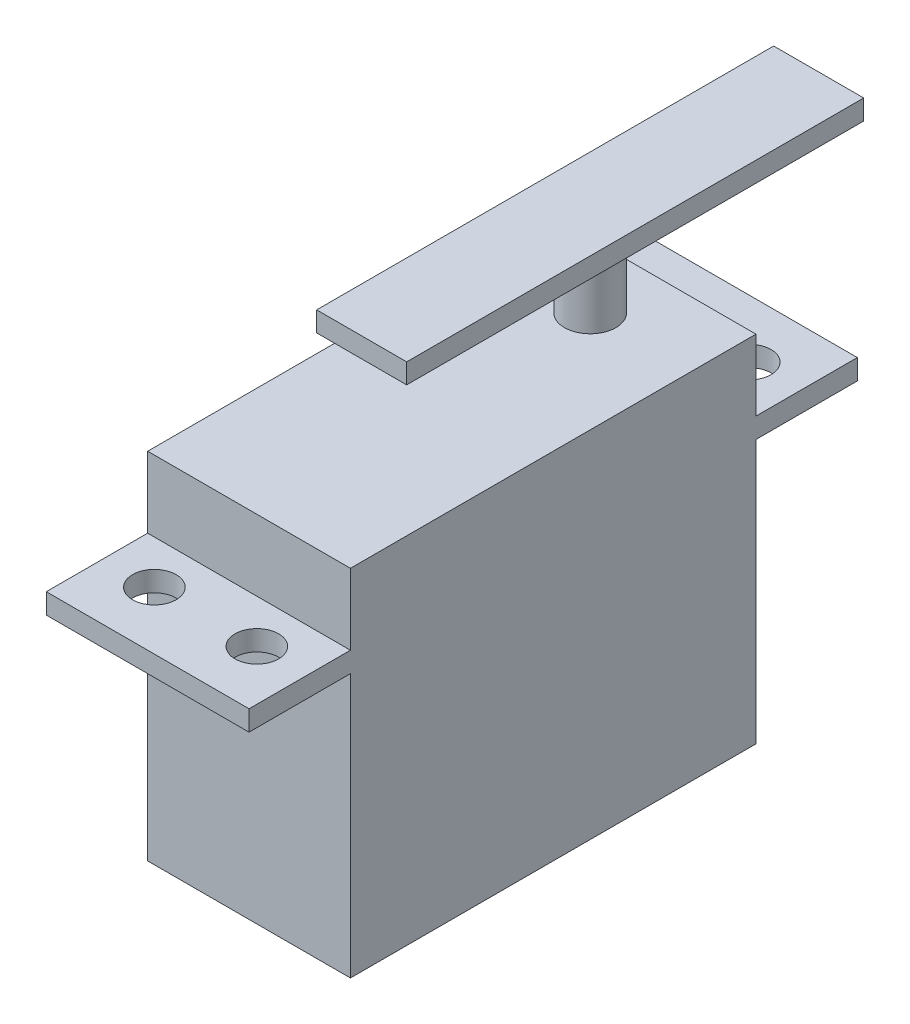
ISO-10303-21;
HEADER;
FILE_DESCRIPTION(('STEP AP214'),'2;1');
FILE_NAME('part.step','',(''),(''),'','','');
FILE_SCHEMA(('AUTOMOTIVE_DESIGN { 1 0 10303 214 1 1 1 1 }'));
ENDSEC;
DATA;
#1=APPLICATION_CONTEXT('core data for automotive mechanical design processes');
#2=APPLICATION_PROTOCOL_DEFINITION('international standard','automotive_design',2000,#1);
#3=PRODUCT_CONTEXT('',#1,'mechanical');
#4=PRODUCT('Part','Part','',(#3));
#5=PRODUCT_RELATED_PRODUCT_CATEGORY('part','',(#4));
#6=PRODUCT_DEFINITION_FORMATION('','',#4);
#7=PRODUCT_DEFINITION_CONTEXT('part definition',#1,'design');
#8=PRODUCT_DEFINITION('design','',#6,#7);
#9=PRODUCT_DEFINITION_SHAPE('','',#8);
#10=(LENGTH_UNIT() NAMED_UNIT(*) SI_UNIT(.MILLI.,.METRE.));
#11=(NAMED_UNIT(*) PLANE_ANGLE_UNIT() SI_UNIT($,.RADIAN.));
#12=(NAMED_UNIT(*) SI_UNIT($,.STERADIAN.) SOLID_ANGLE_UNIT());
#13=UNCERTAINTY_MEASURE_WITH_UNIT(LENGTH_MEASURE(1.E-05),#10,'distance_accuracy_value','');
#14=(GEOMETRIC_REPRESENTATION_CONTEXT(3) GLOBAL_UNCERTAINTY_ASSIGNED_CONTEXT((#13)) GLOBAL_UNIT_ASSIGNED_CONTEXT((#10,
#11,#12)) REPRESENTATION_CONTEXT('',''));
#15=CARTESIAN_POINT('',(0.,0.,0.));
#16=DIRECTION('',(0.,0.,1.));
#17=DIRECTION('',(1.,0.,0.));
#18=AXIS2_PLACEMENT_3D('',#15,#16,#17);
#19=CARTESIAN_POINT('',(-10.,9.,-20.));
#20=DIRECTION('',(0.,0.,1.));
#21=DIRECTION('',(1.,0.,0.));
#22=AXIS2_PLACEMENT_3D('',#19,#20,#21);
#23=PLANE('',#22);
#24=DIRECTION('',(1.,0.,0.));
#25=VECTOR('',#24,1.);
#26=CARTESIAN_POINT('',(9.99999999999999,2.,-20.));
#27=LINE('',#26,#25);
#28=CARTESIAN_POINT('',(-10.,2.,-20.));
#29=VERTEX_POINT('',#28);
#30=CARTESIAN_POINT('',(9.99999999999999,2.,-20.));
#31=VERTEX_POINT('',#30);
#32=EDGE_CURVE('E56',#29,#31,#27,.T.);
#33=ORIENTED_EDGE('',*,*,#32,.F.);
#34=DIRECTION('',(0.,-1.,0.));
#35=VECTOR('',#34,1.);
#36=CARTESIAN_POINT('',(-10.,9.,-20.));
#37=LINE('',#36,#35);
#38=CARTESIAN_POINT('',(-10.,9.,-20.));
#39=VERTEX_POINT('',#38);
#40=EDGE_CURVE('E266',#39,#29,#37,.T.);
#41=ORIENTED_EDGE('',*,*,#40,.F.);
#42=DIRECTION('',(-1.,0.,0.));
#43=VECTOR('',#42,1.);
#44=CARTESIAN_POINT('',(-10.,9.,-20.));
#45=LINE('',#44,#43);
#46=CARTESIAN_POINT('',(9.99999999999999,9.,-20.));
#47=VERTEX_POINT('',#46);
#48=EDGE_CURVE('E146',#47,#39,#45,.T.);
#49=ORIENTED_EDGE('',*,*,#48,.F.);
#50=DIRECTION('',(0.,-1.,0.));
#51=VECTOR('',#50,1.);
#52=CARTESIAN_POINT('',(9.99999999999999,9.,-20.));
#53=LINE('',#52,#51);
#54=EDGE_CURVE('E11',#47,#31,#53,.T.);
#55=ORIENTED_EDGE('',*,*,#54,.T.);
#56=EDGE_LOOP('',(#33,#41,#49,#55));
#57=FACE_BOUND('',#56,.T.);
#58=ADVANCED_FACE('F34',(#57),#23,.F.);
#59=CARTESIAN_POINT('',(-10.,9.,20.));
#60=DIRECTION('',(0.,0.,-1.));
#61=DIRECTION('',(-1.,0.,0.));
#62=AXIS2_PLACEMENT_3D('',#59,#60,#61);
#63=PLANE('',#62);
#64=DIRECTION('',(-1.,0.,0.));
#65=VECTOR('',#64,1.);
#66=CARTESIAN_POINT('',(9.99999999999999,2.,20.));
#67=LINE('',#66,#65);
#68=CARTESIAN_POINT('',(9.99999999999999,2.,20.));
#69=VERTEX_POINT('',#68);
#70=CARTESIAN_POINT('',(-10.,2.,20.));
#71=VERTEX_POINT('',#70);
#72=EDGE_CURVE('E186',#69,#71,#67,.T.);
#73=ORIENTED_EDGE('',*,*,#72,.F.);
#74=DIRECTION('',(0.,-1.,0.));
#75=VECTOR('',#74,1.);
#76=CARTESIAN_POINT('',(9.99999999999999,9.,20.));
#77=LINE('',#76,#75);
#78=CARTESIAN_POINT('',(9.99999999999999,9.,20.));
#79=VERTEX_POINT('',#78);
#80=EDGE_CURVE('E262',#79,#69,#77,.T.);
#81=ORIENTED_EDGE('',*,*,#80,.F.);
#82=DIRECTION('',(1.,0.,0.));
#83=VECTOR('',#82,1.);
#84=CARTESIAN_POINT('',(-10.,9.,20.));
#85=LINE('',#84,#83);
#86=CARTESIAN_POINT('',(-10.,9.,20.));
#87=VERTEX_POINT('',#86);
#88=EDGE_CURVE('E259',#87,#79,#85,.T.);
#89=ORIENTED_EDGE('',*,*,#88,.F.);
#90=DIRECTION('',(0.,-1.,0.));
#91=VECTOR('',#90,1.);
#92=CARTESIAN_POINT('',(-10.,9.,20.));
#93=LINE('',#92,#91);
#94=EDGE_CURVE('E265',#87,#71,#93,.T.);
#95=ORIENTED_EDGE('',*,*,#94,.T.);
#96=EDGE_LOOP('',(#73,#81,#89,#95));
#97=FACE_BOUND('',#96,.T.);
#98=ADVANCED_FACE('F303',(#97),#63,.F.);
#99=CARTESIAN_POINT('',(9.99999999999999,9.,-20.));
#100=DIRECTION('',(-1.,0.,0.));
#101=DIRECTION('',(0.,0.,1.));
#102=AXIS2_PLACEMENT_3D('',#99,#100,#101);
#103=PLANE('',#102);
#104=ORIENTED_EDGE('',*,*,#80,.T.);
#105=DIRECTION('',(0.,0.,-1.));
#106=VECTOR('',#105,1.);
#107=CARTESIAN_POINT('',(9.99999999999999,2.,20.));
#108=LINE('',#107,#106);
#109=CARTESIAN_POINT('',(10.,2.,30.));
#110=VERTEX_POINT('',#109);
#111=EDGE_CURVE('E183',#110,#69,#108,.T.);
#112=ORIENTED_EDGE('',*,*,#111,.F.);
#113=DIRECTION('',(0.,-1.,0.));
#114=VECTOR('',#113,1.);
#115=CARTESIAN_POINT('',(10.,2.,30.));
#116=LINE('',#115,#114);
#117=CARTESIAN_POINT('',(10.,0.,30.));
#118=VERTEX_POINT('',#117);
#119=EDGE_CURVE('E194',#110,#118,#116,.T.);
#120=ORIENTED_EDGE('',*,*,#119,.T.);
#121=DIRECTION('',(0.,0.,-1.));
#122=VECTOR('',#121,1.);
#123=CARTESIAN_POINT('',(9.99999999999999,0.,20.));
#124=LINE('',#123,#122);
#125=CARTESIAN_POINT('',(9.99999999999999,0.,20.));
#126=VERTEX_POINT('',#125);
#127=EDGE_CURVE('E182',#118,#126,#124,.T.);
#128=ORIENTED_EDGE('',*,*,#127,.T.);
#129=CARTESIAN_POINT('',(9.99999999999999,-26.,20.));
#130=VERTEX_POINT('',#129);
#131=EDGE_CURVE('E261',#126,#130,#77,.T.);
#132=ORIENTED_EDGE('',*,*,#131,.T.);
#133=DIRECTION('',(0.,0.,-1.));
#134=VECTOR('',#133,1.);
#135=CARTESIAN_POINT('',(9.99999999999999,-26.,-20.));
#136=LINE('',#135,#134);
#137=CARTESIAN_POINT('',(9.99999999999999,-26.,-20.));
#138=VERTEX_POINT('',#137);
#139=EDGE_CURVE('E241',#130,#138,#136,.T.);
#140=ORIENTED_EDGE('',*,*,#139,.T.);
#141=CARTESIAN_POINT('',(9.99999999999999,0.,-20.));
#142=VERTEX_POINT('',#141);
#143=EDGE_CURVE('E42',#142,#138,#53,.T.);
#144=ORIENTED_EDGE('',*,*,#143,.F.);
#145=DIRECTION('',(0.,0.,-1.));
#146=VECTOR('',#145,1.);
#147=CARTESIAN_POINT('',(9.99999999999999,0.,-20.));
#148=LINE('',#147,#146);
#149=CARTESIAN_POINT('',(10.,0.,-30.));
#150=VERTEX_POINT('',#149);
#151=EDGE_CURVE('E176',#142,#150,#148,.T.);
#152=ORIENTED_EDGE('',*,*,#151,.T.);
#153=DIRECTION('',(0.,-1.,0.));
#154=VECTOR('',#153,1.);
#155=CARTESIAN_POINT('',(10.,2.,-30.));
#156=LINE('',#155,#154);
#157=CARTESIAN_POINT('',(10.,2.,-30.));
#158=VERTEX_POINT('',#157);
#159=EDGE_CURVE('E154',#158,#150,#156,.T.);
#160=ORIENTED_EDGE('',*,*,#159,.F.);
#161=DIRECTION('',(0.,0.,-1.));
#162=VECTOR('',#161,1.);
#163=CARTESIAN_POINT('',(9.99999999999999,2.,-20.));
#164=LINE('',#163,#162);
#165=EDGE_CURVE('E151',#31,#158,#164,.T.);
#166=ORIENTED_EDGE('',*,*,#165,.F.);
#167=ORIENTED_EDGE('',*,*,#54,.F.);
#168=DIRECTION('',(0.,0.,-1.));
#169=VECTOR('',#168,1.);
#170=CARTESIAN_POINT('',(9.99999999999999,9.,-20.));
#171=LINE('',#170,#169);
#172=EDGE_CURVE('E254',#79,#47,#171,.T.);
#173=ORIENTED_EDGE('',*,*,#172,.F.);
#174=EDGE_LOOP('',(#104,#112,#120,#128,#132,#140,#144,#152,#160,#166,#167,#173));
#175=FACE_BOUND('',#174,.T.);
#176=ADVANCED_FACE('F36',(#175),#103,.F.);
#177=CARTESIAN_POINT('',(-10.,0.,-20.));
#178=VERTEX_POINT('',#177);
#179=CARTESIAN_POINT('',(-10.,-26.,-20.));
#180=VERTEX_POINT('',#179);
#181=EDGE_CURVE('E49',#178,#180,#37,.T.);
#182=ORIENTED_EDGE('',*,*,#181,.F.);
#183=DIRECTION('',(1.,0.,0.));
#184=VECTOR('',#183,1.);
#185=CARTESIAN_POINT('',(9.99999999999999,0.,-20.));
#186=LINE('',#185,#184);
#187=EDGE_CURVE('E174',#178,#142,#186,.T.);
#188=ORIENTED_EDGE('',*,*,#187,.T.);
#189=ORIENTED_EDGE('',*,*,#143,.T.);
#190=DIRECTION('',(-1.,0.,0.));
#191=VECTOR('',#190,1.);
#192=CARTESIAN_POINT('',(-10.,-26.,-20.));
#193=LINE('',#192,#191);
#194=EDGE_CURVE('E246',#138,#180,#193,.T.);
#195=ORIENTED_EDGE('',*,*,#194,.T.);
#196=EDGE_LOOP('',(#182,#188,#189,#195));
#197=FACE_BOUND('',#196,.T.);
#198=ADVANCED_FACE('F279',(#197),#23,.F.);
#199=CARTESIAN_POINT('',(-10.,9.,-20.));
#200=DIRECTION('',(1.,0.,0.));
#201=DIRECTION('',(0.,0.,-1.));
#202=AXIS2_PLACEMENT_3D('',#199,#200,#201);
#203=PLANE('',#202);
#204=ORIENTED_EDGE('',*,*,#40,.T.);
#205=DIRECTION('',(0.,0.,1.));
#206=VECTOR('',#205,1.);
#207=CARTESIAN_POINT('',(-10.,2.,-20.));
#208=LINE('',#207,#206);
#209=CARTESIAN_POINT('',(-10.,2.,-30.));
#210=VERTEX_POINT('',#209);
#211=EDGE_CURVE('E162',#210,#29,#208,.T.);
#212=ORIENTED_EDGE('',*,*,#211,.F.);
#213=DIRECTION('',(0.,-1.,0.));
#214=VECTOR('',#213,1.);
#215=CARTESIAN_POINT('',(-10.,2.,-30.));
#216=LINE('',#215,#214);
#217=CARTESIAN_POINT('',(-10.,0.,-30.));
#218=VERTEX_POINT('',#217);
#219=EDGE_CURVE('E173',#210,#218,#216,.T.);
#220=ORIENTED_EDGE('',*,*,#219,.T.);
#221=DIRECTION('',(0.,0.,1.));
#222=VECTOR('',#221,1.);
#223=CARTESIAN_POINT('',(-10.,0.,-20.));
#224=LINE('',#223,#222);
#225=EDGE_CURVE('E163',#218,#178,#224,.T.);
#226=ORIENTED_EDGE('',*,*,#225,.T.);
#227=ORIENTED_EDGE('',*,*,#181,.T.);
#228=DIRECTION('',(0.,0.,1.));
#229=VECTOR('',#228,1.);
#230=CARTESIAN_POINT('',(-10.,-26.,-20.));
#231=LINE('',#230,#229);
#232=CARTESIAN_POINT('',(-10.,-26.,20.));
#233=VERTEX_POINT('',#232);
#234=EDGE_CURVE('E248',#180,#233,#231,.T.);
#235=ORIENTED_EDGE('',*,*,#234,.T.);
#236=CARTESIAN_POINT('',(-10.,0.,20.));
#237=VERTEX_POINT('',#236);
#238=EDGE_CURVE('E264',#237,#233,#93,.T.);
#239=ORIENTED_EDGE('',*,*,#238,.F.);
#240=DIRECTION('',(0.,0.,1.));
#241=VECTOR('',#240,1.);
#242=CARTESIAN_POINT('',(-10.,0.,20.));
#243=LINE('',#242,#241);
#244=CARTESIAN_POINT('',(-10.,0.,30.));
#245=VERTEX_POINT('',#244);
#246=EDGE_CURVE('E199',#237,#245,#243,.T.);
#247=ORIENTED_EDGE('',*,*,#246,.T.);
#248=DIRECTION('',(0.,-1.,0.));
#249=VECTOR('',#248,1.);
#250=CARTESIAN_POINT('',(-10.,2.,30.));
#251=LINE('',#250,#249);
#252=CARTESIAN_POINT('',(-10.,2.,30.));
#253=VERTEX_POINT('',#252);
#254=EDGE_CURVE('E204',#253,#245,#251,.T.);
#255=ORIENTED_EDGE('',*,*,#254,.F.);
#256=DIRECTION('',(0.,0.,1.));
#257=VECTOR('',#256,1.);
#258=CARTESIAN_POINT('',(-10.,2.,20.));
#259=LINE('',#258,#257);
#260=EDGE_CURVE('E190',#71,#253,#259,.T.);
#261=ORIENTED_EDGE('',*,*,#260,.F.);
#262=ORIENTED_EDGE('',*,*,#94,.F.);
#263=DIRECTION('',(0.,0.,1.));
#264=VECTOR('',#263,1.);
#265=CARTESIAN_POINT('',(-10.,9.,-20.));
#266=LINE('',#265,#264);
#267=EDGE_CURVE('E257',#39,#87,#266,.T.);
#268=ORIENTED_EDGE('',*,*,#267,.F.);
#269=EDGE_LOOP('',(#204,#212,#220,#226,#227,#235,#239,#247,#255,#261,#262,#268));
#270=FACE_BOUND('',#269,.T.);
#271=ADVANCED_FACE('F270',(#270),#203,.F.);
#272=ORIENTED_EDGE('',*,*,#131,.F.);
#273=DIRECTION('',(-1.,0.,0.));
#274=VECTOR('',#273,1.);
#275=CARTESIAN_POINT('',(9.99999999999999,0.,20.));
#276=LINE('',#275,#274);
#277=EDGE_CURVE('E197',#126,#237,#276,.T.);
#278=ORIENTED_EDGE('',*,*,#277,.T.);
#279=ORIENTED_EDGE('',*,*,#238,.T.);
#280=DIRECTION('',(1.,0.,0.));
#281=VECTOR('',#280,1.);
#282=CARTESIAN_POINT('',(-10.,-26.,20.));
#283=LINE('',#282,#281);
#284=EDGE_CURVE('E251',#233,#130,#283,.T.);
#285=ORIENTED_EDGE('',*,*,#284,.T.);
#286=EDGE_LOOP('',(#272,#278,#279,#285));
#287=FACE_BOUND('',#286,.T.);
#288=ADVANCED_FACE('F309',(#287),#63,.F.);
#289=CARTESIAN_POINT('',(0.,9.,0.));
#290=DIRECTION('',(0.,1.,0.));
#291=DIRECTION('',(0.,0.,1.));
#292=AXIS2_PLACEMENT_3D('',#289,#290,#291);
#293=PLANE('',#292);
#294=CARTESIAN_POINT('',(0.,9.,-13.65));
#295=DIRECTION('',(0.,1.,0.));
#296=DIRECTION('',(0.,0.,1.));
#297=AXIS2_PLACEMENT_3D('',#294,#295,#296);
#298=CIRCLE('',#297,2.54);
#299=CARTESIAN_POINT('',(0.,9.,-11.11));
#300=VERTEX_POINT('',#299);
#301=EDGE_CURVE('E237',#300,#300,#298,.T.);
#302=ORIENTED_EDGE('',*,*,#301,.F.);
#303=EDGE_LOOP('',(#302));
#304=FACE_BOUND('',#303,.T.);
#305=ORIENTED_EDGE('',*,*,#172,.T.);
#306=ORIENTED_EDGE('',*,*,#48,.T.);
#307=ORIENTED_EDGE('',*,*,#267,.T.);
#308=ORIENTED_EDGE('',*,*,#88,.T.);
#309=EDGE_LOOP('',(#305,#306,#307,#308));
#310=FACE_BOUND('',#309,.T.);
#311=ADVANCED_FACE('F406',(#304,#310),#293,.T.);
#312=CARTESIAN_POINT('',(0.,-26.,0.));
#313=DIRECTION('',(0.,1.,0.));
#314=DIRECTION('',(0.,0.,1.));
#315=AXIS2_PLACEMENT_3D('',#312,#313,#314);
#316=PLANE('',#315);
#317=ORIENTED_EDGE('',*,*,#139,.F.);
#318=ORIENTED_EDGE('',*,*,#284,.F.);
#319=ORIENTED_EDGE('',*,*,#234,.F.);
#320=ORIENTED_EDGE('',*,*,#194,.F.);
#321=EDGE_LOOP('',(#317,#318,#319,#320));
#322=FACE_BOUND('',#321,.T.);
#323=ADVANCED_FACE('F278',(#322),#316,.F.);
#324=CARTESIAN_POINT('',(0.,16.33,-13.65));
#325=DIRECTION('',(0.,-1.,0.));
#326=DIRECTION('',(0.,0.,-1.));
#327=AXIS2_PLACEMENT_3D('',#324,#325,#326);
#328=CYLINDRICAL_SURFACE('',#327,2.54);
#329=CARTESIAN_POINT('',(0.,16.33,-13.65));
#330=DIRECTION('',(0.,1.,0.));
#331=DIRECTION('',(0.,0.,1.));
#332=AXIS2_PLACEMENT_3D('',#329,#330,#331);
#333=CIRCLE('',#332,2.54);
#334=CARTESIAN_POINT('',(0.,16.33,-11.11));
#335=VERTEX_POINT('',#334);
#336=EDGE_CURVE('E238',#335,#335,#333,.T.);
#337=ORIENTED_EDGE('',*,*,#336,.F.);
#338=EDGE_LOOP('',(#337));
#339=FACE_BOUND('',#338,.T.);
#340=ORIENTED_EDGE('',*,*,#301,.T.);
#341=EDGE_LOOP('',(#340));
#342=FACE_BOUND('',#341,.T.);
#343=ADVANCED_FACE('F389',(#339,#342),#328,.T.);
#344=CARTESIAN_POINT('',(4.44,18.3,-36.19));
#345=DIRECTION('',(-1.,0.,0.));
#346=DIRECTION('',(0.,0.,1.));
#347=AXIS2_PLACEMENT_3D('',#344,#345,#346);
#348=PLANE('',#347);
#349=DIRECTION('',(0.,0.,-1.));
#350=VECTOR('',#349,1.);
#351=CARTESIAN_POINT('',(4.44,16.33,-36.19));
#352=LINE('',#351,#350);
#353=CARTESIAN_POINT('',(4.44,16.33,8.89));
#354=VERTEX_POINT('',#353);
#355=CARTESIAN_POINT('',(4.44,16.33,-36.19));
#356=VERTEX_POINT('',#355);
#357=EDGE_CURVE('E207',#354,#356,#352,.T.);
#358=ORIENTED_EDGE('',*,*,#357,.T.);
#359=DIRECTION('',(0.,-1.,0.));
#360=VECTOR('',#359,1.);
#361=CARTESIAN_POINT('',(4.44,18.3,-36.19));
#362=LINE('',#361,#360);
#363=CARTESIAN_POINT('',(4.44,18.3,-36.19));
#364=VERTEX_POINT('',#363);
#365=EDGE_CURVE('E234',#364,#356,#362,.T.);
#366=ORIENTED_EDGE('',*,*,#365,.F.);
#367=DIRECTION('',(0.,0.,-1.));
#368=VECTOR('',#367,1.);
#369=CARTESIAN_POINT('',(4.44,18.3,-36.19));
#370=LINE('',#369,#368);
#371=CARTESIAN_POINT('',(4.44,18.3,8.89));
#372=VERTEX_POINT('',#371);
#373=EDGE_CURVE('E208',#372,#364,#370,.T.);
#374=ORIENTED_EDGE('',*,*,#373,.F.);
#375=DIRECTION('',(0.,-1.,0.));
#376=VECTOR('',#375,1.);
#377=CARTESIAN_POINT('',(4.44,18.3,8.89));
#378=LINE('',#377,#376);
#379=EDGE_CURVE('E218',#372,#354,#378,.T.);
#380=ORIENTED_EDGE('',*,*,#379,.T.);
#381=EDGE_LOOP('',(#358,#366,#374,#380));
#382=FACE_BOUND('',#381,.T.);
#383=ADVANCED_FACE('F379',(#382),#348,.F.);
#384=CARTESIAN_POINT('',(-4.44,18.3,-36.19));
#385=DIRECTION('',(0.,0.,1.));
#386=DIRECTION('',(1.,0.,0.));
#387=AXIS2_PLACEMENT_3D('',#384,#385,#386);
#388=PLANE('',#387);
#389=DIRECTION('',(-1.,0.,0.));
#390=VECTOR('',#389,1.);
#391=CARTESIAN_POINT('',(-4.44,16.33,-36.19));
#392=LINE('',#391,#390);
#393=CARTESIAN_POINT('',(-4.44,16.33,-36.19));
#394=VERTEX_POINT('',#393);
#395=EDGE_CURVE('E221',#356,#394,#392,.T.);
#396=ORIENTED_EDGE('',*,*,#395,.T.);
#397=DIRECTION('',(0.,-1.,0.));
#398=VECTOR('',#397,1.);
#399=CARTESIAN_POINT('',(-4.44,18.3,-36.19));
#400=LINE('',#399,#398);
#401=CARTESIAN_POINT('',(-4.44,18.3,-36.19));
#402=VERTEX_POINT('',#401);
#403=EDGE_CURVE('E231',#402,#394,#400,.T.);
#404=ORIENTED_EDGE('',*,*,#403,.F.);
#405=DIRECTION('',(-1.,0.,0.));
#406=VECTOR('',#405,1.);
#407=CARTESIAN_POINT('',(-4.44,18.3,-36.19));
#408=LINE('',#407,#406);
#409=EDGE_CURVE('E211',#364,#402,#408,.T.);
#410=ORIENTED_EDGE('',*,*,#409,.F.);
#411=ORIENTED_EDGE('',*,*,#365,.T.);
#412=EDGE_LOOP('',(#396,#404,#410,#411));
#413=FACE_BOUND('',#412,.T.);
#414=ADVANCED_FACE('F369',(#413),#388,.F.);
#415=CARTESIAN_POINT('',(-4.44,18.3,-36.19));
#416=DIRECTION('',(1.,0.,0.));
#417=DIRECTION('',(0.,0.,-1.));
#418=AXIS2_PLACEMENT_3D('',#415,#416,#417);
#419=PLANE('',#418);
#420=DIRECTION('',(0.,0.,1.));
#421=VECTOR('',#420,1.);
#422=CARTESIAN_POINT('',(-4.44,16.33,-36.19));
#423=LINE('',#422,#421);
#424=CARTESIAN_POINT('',(-4.44,16.33,8.89));
#425=VERTEX_POINT('',#424);
#426=EDGE_CURVE('E223',#394,#425,#423,.T.);
#427=ORIENTED_EDGE('',*,*,#426,.T.);
#428=DIRECTION('',(0.,-1.,0.));
#429=VECTOR('',#428,1.);
#430=CARTESIAN_POINT('',(-4.44,18.3,8.89));
#431=LINE('',#430,#429);
#432=CARTESIAN_POINT('',(-4.44,18.3,8.89));
#433=VERTEX_POINT('',#432);
#434=EDGE_CURVE('E228',#433,#425,#431,.T.);
#435=ORIENTED_EDGE('',*,*,#434,.F.);
#436=DIRECTION('',(0.,0.,1.));
#437=VECTOR('',#436,1.);
#438=CARTESIAN_POINT('',(-4.44,18.3,-36.19));
#439=LINE('',#438,#437);
#440=EDGE_CURVE('E214',#402,#433,#439,.T.);
#441=ORIENTED_EDGE('',*,*,#440,.F.);
#442=ORIENTED_EDGE('',*,*,#403,.T.);
#443=EDGE_LOOP('',(#427,#435,#441,#442));
#444=FACE_BOUND('',#443,.T.);
#445=ADVANCED_FACE('F359',(#444),#419,.F.);
#446=CARTESIAN_POINT('',(-4.44,18.3,8.89));
#447=DIRECTION('',(0.,0.,-1.));
#448=DIRECTION('',(-1.,0.,0.));
#449=AXIS2_PLACEMENT_3D('',#446,#447,#448);
#450=PLANE('',#449);
#451=DIRECTION('',(1.,0.,0.));
#452=VECTOR('',#451,1.);
#453=CARTESIAN_POINT('',(-4.44,16.33,8.89));
#454=LINE('',#453,#452);
#455=EDGE_CURVE('E212',#425,#354,#454,.T.);
#456=ORIENTED_EDGE('',*,*,#455,.T.);
#457=ORIENTED_EDGE('',*,*,#379,.F.);
#458=DIRECTION('',(1.,0.,0.));
#459=VECTOR('',#458,1.);
#460=CARTESIAN_POINT('',(-4.44,18.3,8.89));
#461=LINE('',#460,#459);
#462=EDGE_CURVE('E216',#433,#372,#461,.T.);
#463=ORIENTED_EDGE('',*,*,#462,.F.);
#464=ORIENTED_EDGE('',*,*,#434,.T.);
#465=EDGE_LOOP('',(#456,#457,#463,#464));
#466=FACE_BOUND('',#465,.T.);
#467=ADVANCED_FACE('F349',(#466),#450,.F.);
#468=CARTESIAN_POINT('',(0.,18.3,0.));
#469=DIRECTION('',(0.,1.,0.));
#470=DIRECTION('',(0.,0.,1.));
#471=AXIS2_PLACEMENT_3D('',#468,#469,#470);
#472=PLANE('',#471);
#473=ORIENTED_EDGE('',*,*,#373,.T.);
#474=ORIENTED_EDGE('',*,*,#409,.T.);
#475=ORIENTED_EDGE('',*,*,#440,.T.);
#476=ORIENTED_EDGE('',*,*,#462,.T.);
#477=EDGE_LOOP('',(#473,#474,#475,#476));
#478=FACE_BOUND('',#477,.T.);
#479=ADVANCED_FACE('F338',(#478),#472,.T.);
#480=CARTESIAN_POINT('',(0.,16.33,0.));
#481=DIRECTION('',(0.,1.,0.));
#482=DIRECTION('',(0.,0.,1.));
#483=AXIS2_PLACEMENT_3D('',#480,#481,#482);
#484=PLANE('',#483);
#485=ORIENTED_EDGE('',*,*,#336,.T.);
#486=EDGE_LOOP('',(#485));
#487=FACE_BOUND('',#486,.T.);
#488=ORIENTED_EDGE('',*,*,#357,.F.);
#489=ORIENTED_EDGE('',*,*,#455,.F.);
#490=ORIENTED_EDGE('',*,*,#426,.F.);
#491=ORIENTED_EDGE('',*,*,#395,.F.);
#492=EDGE_LOOP('',(#488,#489,#490,#491));
#493=FACE_BOUND('',#492,.T.);
#494=ADVANCED_FACE('F333',(#487,#493),#484,.F.);
#495=CARTESIAN_POINT('',(10.,2.,30.));
#496=DIRECTION('',(0.,0.,-1.));
#497=DIRECTION('',(-1.,0.,0.));
#498=AXIS2_PLACEMENT_3D('',#495,#496,#497);
#499=PLANE('',#498);
#500=DIRECTION('',(1.,0.,0.));
#501=VECTOR('',#500,1.);
#502=CARTESIAN_POINT('',(10.,0.,30.));
#503=LINE('',#502,#501);
#504=EDGE_CURVE('E187',#245,#118,#503,.T.);
#505=ORIENTED_EDGE('',*,*,#504,.T.);
#506=ORIENTED_EDGE('',*,*,#119,.F.);
#507=DIRECTION('',(1.,0.,0.));
#508=VECTOR('',#507,1.);
#509=CARTESIAN_POINT('',(10.,2.,30.));
#510=LINE('',#509,#508);
#511=EDGE_CURVE('E192',#253,#110,#510,.T.);
#512=ORIENTED_EDGE('',*,*,#511,.F.);
#513=ORIENTED_EDGE('',*,*,#254,.T.);
#514=EDGE_LOOP('',(#505,#506,#512,#513));
#515=FACE_BOUND('',#514,.T.);
#516=ADVANCED_FACE('F337',(#515),#499,.F.);
#517=CARTESIAN_POINT('',(0.,2.,0.));
#518=DIRECTION('',(0.,-1.,0.));
#519=DIRECTION('',(0.,0.,-1.));
#520=AXIS2_PLACEMENT_3D('',#517,#518,#519);
#521=PLANE('',#520);
#522=CARTESIAN_POINT('',(5.055,2.,24.285));
#523=DIRECTION('',(0.,-1.,0.));
#524=DIRECTION('',(0.,0.,-1.));
#525=AXIS2_PLACEMENT_3D('',#522,#523,#524);
#526=CIRCLE('',#525,2.15);
#527=CARTESIAN_POINT('',(5.055,2.,22.135));
#528=VERTEX_POINT('',#527);
#529=EDGE_CURVE('E168',#528,#528,#526,.F.);
#530=ORIENTED_EDGE('',*,*,#529,.F.);
#531=EDGE_LOOP('',(#530));
#532=FACE_BOUND('',#531,.T.);
#533=CARTESIAN_POINT('',(-5.055,2.,24.285));
#534=DIRECTION('',(0.,-1.,0.));
#535=DIRECTION('',(0.,0.,-1.));
#536=AXIS2_PLACEMENT_3D('',#533,#534,#535);
#537=CIRCLE('',#536,2.15);
#538=CARTESIAN_POINT('',(-5.055,2.,22.135));
#539=VERTEX_POINT('',#538);
#540=EDGE_CURVE('E452',#539,#539,#537,.F.);
#541=ORIENTED_EDGE('',*,*,#540,.F.);
#542=EDGE_LOOP('',(#541));
#543=FACE_BOUND('',#542,.T.);
#544=ORIENTED_EDGE('',*,*,#111,.T.);
#545=ORIENTED_EDGE('',*,*,#72,.T.);
#546=ORIENTED_EDGE('',*,*,#260,.T.);
#547=ORIENTED_EDGE('',*,*,#511,.T.);
#548=EDGE_LOOP('',(#544,#545,#546,#547));
#549=FACE_BOUND('',#548,.T.);
#550=ADVANCED_FACE('F297',(#532,#543,#549),#521,.F.);
#551=CARTESIAN_POINT('',(0.,0.,0.));
#552=DIRECTION('',(0.,-1.,0.));
#553=DIRECTION('',(0.,0.,-1.));
#554=AXIS2_PLACEMENT_3D('',#551,#552,#553);
#555=PLANE('',#554);
#556=CARTESIAN_POINT('',(5.055,0.,24.285));
#557=DIRECTION('',(0.,1.,0.));
#558=DIRECTION('',(0.,0.,1.));
#559=AXIS2_PLACEMENT_3D('',#556,#557,#558);
#560=CIRCLE('',#559,2.15);
#561=CARTESIAN_POINT('',(5.055,0.,26.435));
#562=VERTEX_POINT('',#561);
#563=EDGE_CURVE('E464',#562,#562,#560,.T.);
#564=ORIENTED_EDGE('',*,*,#563,.T.);
#565=EDGE_LOOP('',(#564));
#566=FACE_BOUND('',#565,.T.);
#567=CARTESIAN_POINT('',(-5.055,0.,24.285));
#568=DIRECTION('',(0.,1.,0.));
#569=DIRECTION('',(0.,0.,1.));
#570=AXIS2_PLACEMENT_3D('',#567,#568,#569);
#571=CIRCLE('',#570,2.15);
#572=CARTESIAN_POINT('',(-5.055,0.,26.435));
#573=VERTEX_POINT('',#572);
#574=EDGE_CURVE('E461',#573,#573,#571,.T.);
#575=ORIENTED_EDGE('',*,*,#574,.T.);
#576=EDGE_LOOP('',(#575));
#577=FACE_BOUND('',#576,.T.);
#578=ORIENTED_EDGE('',*,*,#127,.F.);
#579=ORIENTED_EDGE('',*,*,#504,.F.);
#580=ORIENTED_EDGE('',*,*,#246,.F.);
#581=ORIENTED_EDGE('',*,*,#277,.F.);
#582=EDGE_LOOP('',(#578,#579,#580,#581));
#583=FACE_BOUND('',#582,.T.);
#584=ADVANCED_FACE('F289',(#566,#577,#583),#555,.T.);
#585=CARTESIAN_POINT('',(10.,2.,-30.));
#586=DIRECTION('',(0.,0.,1.));
#587=DIRECTION('',(1.,0.,0.));
#588=AXIS2_PLACEMENT_3D('',#585,#586,#587);
#589=PLANE('',#588);
#590=DIRECTION('',(-1.,0.,0.));
#591=VECTOR('',#590,1.);
#592=CARTESIAN_POINT('',(10.,0.,-30.));
#593=LINE('',#592,#591);
#594=EDGE_CURVE('E165',#150,#218,#593,.T.);
#595=ORIENTED_EDGE('',*,*,#594,.T.);
#596=ORIENTED_EDGE('',*,*,#219,.F.);
#597=DIRECTION('',(-1.,0.,0.));
#598=VECTOR('',#597,1.);
#599=CARTESIAN_POINT('',(10.,2.,-30.));
#600=LINE('',#599,#598);
#601=EDGE_CURVE('E157',#158,#210,#600,.T.);
#602=ORIENTED_EDGE('',*,*,#601,.F.);
#603=ORIENTED_EDGE('',*,*,#159,.T.);
#604=EDGE_LOOP('',(#595,#596,#602,#603));
#605=FACE_BOUND('',#604,.T.);
#606=ADVANCED_FACE('F287',(#605),#589,.F.);
#607=CARTESIAN_POINT('',(0.,2.,0.));
#608=DIRECTION('',(0.,-1.,0.));
#609=DIRECTION('',(0.,0.,-1.));
#610=AXIS2_PLACEMENT_3D('',#607,#608,#609);
#611=PLANE('',#610);
#612=CARTESIAN_POINT('',(-5.055,2.,-24.285));
#613=DIRECTION('',(0.,-1.,0.));
#614=DIRECTION('',(0.,0.,-1.));
#615=AXIS2_PLACEMENT_3D('',#612,#613,#614);
#616=CIRCLE('',#615,2.15);
#617=CARTESIAN_POINT('',(-5.055,2.,-26.435));
#618=VERTEX_POINT('',#617);
#619=EDGE_CURVE('E454',#618,#618,#616,.F.);
#620=ORIENTED_EDGE('',*,*,#619,.F.);
#621=EDGE_LOOP('',(#620));
#622=FACE_BOUND('',#621,.T.);
#623=CARTESIAN_POINT('',(5.055,2.,-24.285));
#624=DIRECTION('',(0.,-1.,0.));
#625=DIRECTION('',(0.,0.,-1.));
#626=AXIS2_PLACEMENT_3D('',#623,#624,#625);
#627=CIRCLE('',#626,2.15);
#628=CARTESIAN_POINT('',(5.055,2.,-26.435));
#629=VERTEX_POINT('',#628);
#630=EDGE_CURVE('E456',#629,#629,#627,.F.);
#631=ORIENTED_EDGE('',*,*,#630,.F.);
#632=EDGE_LOOP('',(#631));
#633=FACE_BOUND('',#632,.T.);
#634=ORIENTED_EDGE('',*,*,#32,.T.);
#635=ORIENTED_EDGE('',*,*,#165,.T.);
#636=ORIENTED_EDGE('',*,*,#601,.T.);
#637=ORIENTED_EDGE('',*,*,#211,.T.);
#638=EDGE_LOOP('',(#634,#635,#636,#637));
#639=FACE_BOUND('',#638,.T.);
#640=ADVANCED_FACE('F160',(#622,#633,#639),#611,.F.);
#641=CARTESIAN_POINT('',(0.,0.,0.));
#642=DIRECTION('',(0.,-1.,0.));
#643=DIRECTION('',(0.,0.,-1.));
#644=AXIS2_PLACEMENT_3D('',#641,#642,#643);
#645=PLANE('',#644);
#646=CARTESIAN_POINT('',(-5.055,0.,-24.285));
#647=DIRECTION('',(0.,1.,0.));
#648=DIRECTION('',(0.,0.,1.));
#649=AXIS2_PLACEMENT_3D('',#646,#647,#648);
#650=CIRCLE('',#649,2.15);
#651=CARTESIAN_POINT('',(-5.055,0.,-22.135));
#652=VERTEX_POINT('',#651);
#653=EDGE_CURVE('E465',#652,#652,#650,.T.);
#654=ORIENTED_EDGE('',*,*,#653,.T.);
#655=EDGE_LOOP('',(#654));
#656=FACE_BOUND('',#655,.T.);
#657=CARTESIAN_POINT('',(5.055,0.,-24.285));
#658=DIRECTION('',(0.,1.,0.));
#659=DIRECTION('',(0.,0.,1.));
#660=AXIS2_PLACEMENT_3D('',#657,#658,#659);
#661=CIRCLE('',#660,2.15);
#662=CARTESIAN_POINT('',(5.055,0.,-22.135));
#663=VERTEX_POINT('',#662);
#664=EDGE_CURVE('E468',#663,#663,#661,.T.);
#665=ORIENTED_EDGE('',*,*,#664,.T.);
#666=EDGE_LOOP('',(#665));
#667=FACE_BOUND('',#666,.T.);
#668=ORIENTED_EDGE('',*,*,#187,.F.);
#669=ORIENTED_EDGE('',*,*,#225,.F.);
#670=ORIENTED_EDGE('',*,*,#594,.F.);
#671=ORIENTED_EDGE('',*,*,#151,.F.);
#672=EDGE_LOOP('',(#668,#669,#670,#671));
#673=FACE_BOUND('',#672,.T.);
#674=ADVANCED_FACE('F284',(#656,#667,#673),#645,.T.);
#675=CARTESIAN_POINT('',(5.055,5.159375,-24.285));
#676=DIRECTION('',(0.,-1.,0.));
#677=DIRECTION('',(0.,0.,-1.));
#678=AXIS2_PLACEMENT_3D('',#675,#676,#677);
#679=CYLINDRICAL_SURFACE('',#678,2.15);
#680=ORIENTED_EDGE('',*,*,#664,.F.);
#681=EDGE_LOOP('',(#680));
#682=FACE_BOUND('',#681,.T.);
#683=ORIENTED_EDGE('',*,*,#630,.T.);
#684=EDGE_LOOP('',(#683));
#685=FACE_BOUND('',#684,.T.);
#686=ADVANCED_FACE('F475',(#682,#685),#679,.F.);
#687=CARTESIAN_POINT('',(-5.055,5.159375,-24.285));
#688=DIRECTION('',(0.,-1.,0.));
#689=DIRECTION('',(0.,0.,-1.));
#690=AXIS2_PLACEMENT_3D('',#687,#688,#689);
#691=CYLINDRICAL_SURFACE('',#690,2.15);
#692=ORIENTED_EDGE('',*,*,#653,.F.);
#693=EDGE_LOOP('',(#692));
#694=FACE_BOUND('',#693,.T.);
#695=ORIENTED_EDGE('',*,*,#619,.T.);
#696=EDGE_LOOP('',(#695));
#697=FACE_BOUND('',#696,.T.);
#698=ADVANCED_FACE('F478',(#694,#697),#691,.F.);
#699=CARTESIAN_POINT('',(-5.055,5.159375,24.285));
#700=DIRECTION('',(0.,-1.,0.));
#701=DIRECTION('',(0.,0.,-1.));
#702=AXIS2_PLACEMENT_3D('',#699,#700,#701);
#703=CYLINDRICAL_SURFACE('',#702,2.15);
#704=ORIENTED_EDGE('',*,*,#574,.F.);
#705=EDGE_LOOP('',(#704));
#706=FACE_BOUND('',#705,.T.);
#707=ORIENTED_EDGE('',*,*,#540,.T.);
#708=EDGE_LOOP('',(#707));
#709=FACE_BOUND('',#708,.T.);
#710=ADVANCED_FACE('F486',(#706,#709),#703,.F.);
#711=CARTESIAN_POINT('',(5.055,5.159375,24.285));
#712=DIRECTION('',(0.,-1.,0.));
#713=DIRECTION('',(0.,0.,-1.));
#714=AXIS2_PLACEMENT_3D('',#711,#712,#713);
#715=CYLINDRICAL_SURFACE('',#714,2.15);
#716=ORIENTED_EDGE('',*,*,#563,.F.);
#717=EDGE_LOOP('',(#716));
#718=FACE_BOUND('',#717,.T.);
#719=ORIENTED_EDGE('',*,*,#529,.T.);
#720=EDGE_LOOP('',(#719));
#721=FACE_BOUND('',#720,.T.);
#722=ADVANCED_FACE('F491',(#718,#721),#715,.F.);
#723=CLOSED_SHELL('',(#58,#98,#176,#198,#271,#288,#311,#323,#343,#383,#414,#445,#467,#479,#494,
#516,#550,#584,#606,#640,#674,#686,#698,#710,#722));
#724=MANIFOLD_SOLID_BREP('B2',#723);
#725=ADVANCED_BREP_SHAPE_REPRESENTATION('',(#18,#724),#14);
#726=SHAPE_DEFINITION_REPRESENTATION(#9,#725);
ENDSEC;
END-ISO-10303-21;
